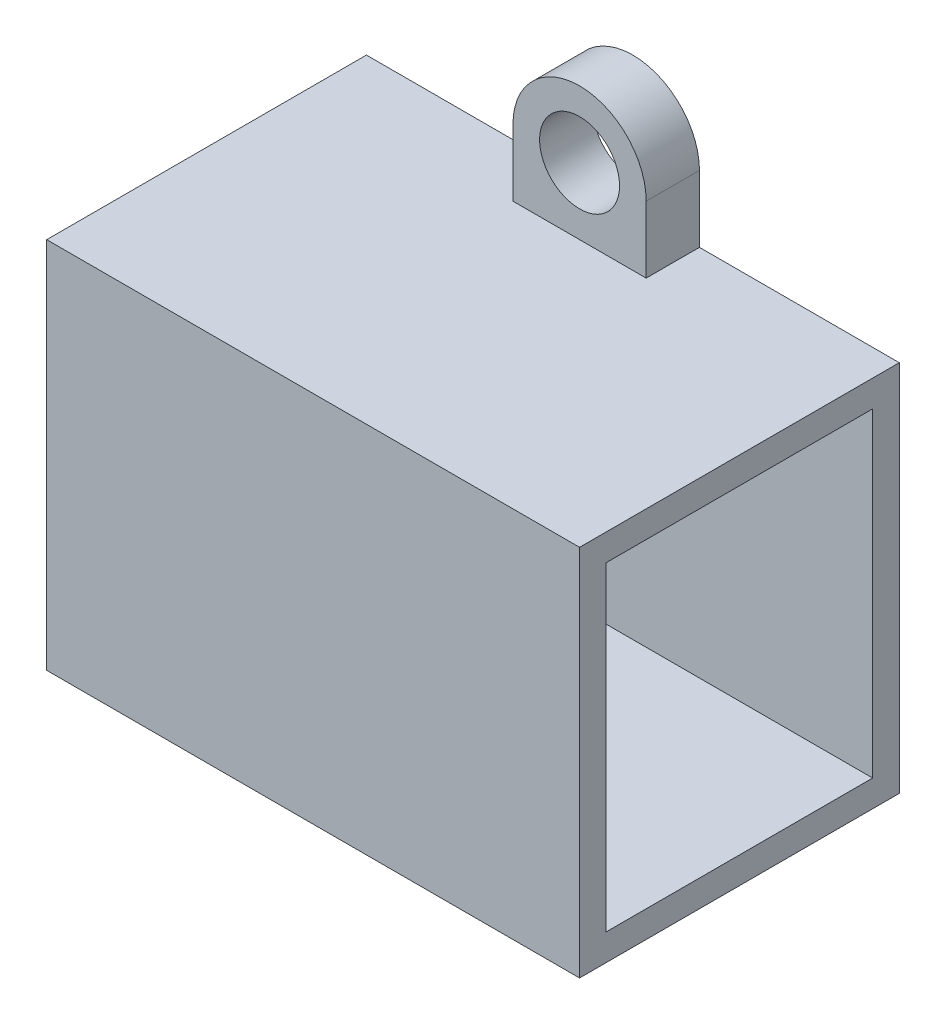
ISO-10303-21;
HEADER;
FILE_DESCRIPTION(('STEP AP214'),'2;1');
FILE_NAME('part.step','',(''),(''),'','','');
FILE_SCHEMA(('AUTOMOTIVE_DESIGN { 1 0 10303 214 1 1 1 1 }'));
ENDSEC;
DATA;
#1=APPLICATION_CONTEXT('core data for automotive mechanical design processes');
#2=APPLICATION_PROTOCOL_DEFINITION('international standard','automotive_design',2000,#1);
#3=PRODUCT_CONTEXT('',#1,'mechanical');
#4=PRODUCT('Part','Part','',(#3));
#5=PRODUCT_RELATED_PRODUCT_CATEGORY('part','',(#4));
#6=PRODUCT_DEFINITION_FORMATION('','',#4);
#7=PRODUCT_DEFINITION_CONTEXT('part definition',#1,'design');
#8=PRODUCT_DEFINITION('design','',#6,#7);
#9=PRODUCT_DEFINITION_SHAPE('','',#8);
#10=(LENGTH_UNIT() NAMED_UNIT(*) SI_UNIT(.MILLI.,.METRE.));
#11=(NAMED_UNIT(*) PLANE_ANGLE_UNIT() SI_UNIT($,.RADIAN.));
#12=(NAMED_UNIT(*) SI_UNIT($,.STERADIAN.) SOLID_ANGLE_UNIT());
#13=UNCERTAINTY_MEASURE_WITH_UNIT(LENGTH_MEASURE(1.E-05),#10,'distance_accuracy_value','');
#14=(GEOMETRIC_REPRESENTATION_CONTEXT(3) GLOBAL_UNCERTAINTY_ASSIGNED_CONTEXT((#13)) GLOBAL_UNIT_ASSIGNED_CONTEXT((#10,
#11,#12)) REPRESENTATION_CONTEXT('',''));
#15=CARTESIAN_POINT('',(0.,0.,0.));
#16=DIRECTION('',(0.,0.,1.));
#17=DIRECTION('',(1.,0.,0.));
#18=AXIS2_PLACEMENT_3D('',#15,#16,#17);
#19=CARTESIAN_POINT('',(10.,7.,12.));
#20=DIRECTION('',(-1.,0.,0.));
#21=DIRECTION('',(0.,-1.,0.));
#22=AXIS2_PLACEMENT_3D('',#19,#20,#21);
#23=PLANE('',#22);
#24=DIRECTION('',(0.,1.,0.));
#25=VECTOR('',#24,1.);
#26=CARTESIAN_POINT('',(10.,7.,0.));
#27=LINE('',#26,#25);
#28=CARTESIAN_POINT('',(10.,-7.,0.));
#29=VERTEX_POINT('',#28);
#30=CARTESIAN_POINT('',(10.,7.,0.));
#31=VERTEX_POINT('',#30);
#32=EDGE_CURVE('E291',#29,#31,#27,.T.);
#33=ORIENTED_EDGE('',*,*,#32,.T.);
#34=DIRECTION('',(0.,0.,-1.));
#35=VECTOR('',#34,1.);
#36=CARTESIAN_POINT('',(10.,7.,12.));
#37=LINE('',#36,#35);
#38=CARTESIAN_POINT('',(10.,7.,12.));
#39=VERTEX_POINT('',#38);
#40=EDGE_CURVE('E11',#39,#31,#37,.T.);
#41=ORIENTED_EDGE('',*,*,#40,.F.);
#42=DIRECTION('',(0.,1.,0.));
#43=VECTOR('',#42,1.);
#44=CARTESIAN_POINT('',(10.,7.,12.));
#45=LINE('',#44,#43);
#46=CARTESIAN_POINT('',(10.,-7.,12.));
#47=VERTEX_POINT('',#46);
#48=EDGE_CURVE('E292',#47,#39,#45,.T.);
#49=ORIENTED_EDGE('',*,*,#48,.F.);
#50=DIRECTION('',(0.,0.,-1.));
#51=VECTOR('',#50,1.);
#52=CARTESIAN_POINT('',(10.,-7.,12.));
#53=LINE('',#52,#51);
#54=EDGE_CURVE('E306',#47,#29,#53,.T.);
#55=ORIENTED_EDGE('',*,*,#54,.T.);
#56=EDGE_LOOP('',(#33,#41,#49,#55));
#57=FACE_BOUND('',#56,.T.);
#58=DIRECTION('',(0.,1.,0.));
#59=VECTOR('',#58,1.);
#60=CARTESIAN_POINT('',(10.,7.,1.));
#61=LINE('',#60,#59);
#62=CARTESIAN_POINT('',(10.,-6.,1.));
#63=VERTEX_POINT('',#62);
#64=CARTESIAN_POINT('',(10.,6.,1.));
#65=VERTEX_POINT('',#64);
#66=EDGE_CURVE('E159',#63,#65,#61,.T.);
#67=ORIENTED_EDGE('',*,*,#66,.F.);
#68=DIRECTION('',(0.,0.,-1.));
#69=VECTOR('',#68,1.);
#70=CARTESIAN_POINT('',(10.,-6.,12.));
#71=LINE('',#70,#69);
#72=CARTESIAN_POINT('',(10.,-6.,11.));
#73=VERTEX_POINT('',#72);
#74=EDGE_CURVE('E186',#73,#63,#71,.T.);
#75=ORIENTED_EDGE('',*,*,#74,.F.);
#76=DIRECTION('',(0.,1.,0.));
#77=VECTOR('',#76,1.);
#78=CARTESIAN_POINT('',(10.,7.,11.));
#79=LINE('',#78,#77);
#80=CARTESIAN_POINT('',(10.,6.,11.));
#81=VERTEX_POINT('',#80);
#82=EDGE_CURVE('E55',#73,#81,#79,.T.);
#83=ORIENTED_EDGE('',*,*,#82,.T.);
#84=DIRECTION('',(0.,0.,-1.));
#85=VECTOR('',#84,1.);
#86=CARTESIAN_POINT('',(10.,6.,12.));
#87=LINE('',#86,#85);
#88=EDGE_CURVE('E171',#81,#65,#87,.T.);
#89=ORIENTED_EDGE('',*,*,#88,.T.);
#90=EDGE_LOOP('',(#67,#75,#83,#89));
#91=FACE_BOUND('',#90,.T.);
#92=ADVANCED_FACE('F40',(#57,#91),#23,.F.);
#93=CARTESIAN_POINT('',(-10.,7.,12.));
#94=DIRECTION('',(1.,0.,0.));
#95=DIRECTION('',(0.,1.,0.));
#96=AXIS2_PLACEMENT_3D('',#93,#94,#95);
#97=PLANE('',#96);
#98=DIRECTION('',(0.,-1.,0.));
#99=VECTOR('',#98,1.);
#100=CARTESIAN_POINT('',(-10.,7.,0.));
#101=LINE('',#100,#99);
#102=CARTESIAN_POINT('',(-10.,7.,0.));
#103=VERTEX_POINT('',#102);
#104=CARTESIAN_POINT('',(-10.,-7.,0.));
#105=VERTEX_POINT('',#104);
#106=EDGE_CURVE('E314',#103,#105,#101,.T.);
#107=ORIENTED_EDGE('',*,*,#106,.T.);
#108=DIRECTION('',(0.,0.,-1.));
#109=VECTOR('',#108,1.);
#110=CARTESIAN_POINT('',(-10.,-7.,12.));
#111=LINE('',#110,#109);
#112=CARTESIAN_POINT('',(-10.,-7.,12.));
#113=VERTEX_POINT('',#112);
#114=EDGE_CURVE('E324',#113,#105,#111,.T.);
#115=ORIENTED_EDGE('',*,*,#114,.F.);
#116=DIRECTION('',(0.,-1.,0.));
#117=VECTOR('',#116,1.);
#118=CARTESIAN_POINT('',(-10.,7.,12.));
#119=LINE('',#118,#117);
#120=CARTESIAN_POINT('',(-10.,7.,12.));
#121=VERTEX_POINT('',#120);
#122=EDGE_CURVE('E300',#121,#113,#119,.T.);
#123=ORIENTED_EDGE('',*,*,#122,.F.);
#124=DIRECTION('',(0.,0.,-1.));
#125=VECTOR('',#124,1.);
#126=CARTESIAN_POINT('',(-10.,7.,12.));
#127=LINE('',#126,#125);
#128=EDGE_CURVE('E48',#121,#103,#127,.T.);
#129=ORIENTED_EDGE('',*,*,#128,.T.);
#130=EDGE_LOOP('',(#107,#115,#123,#129));
#131=FACE_BOUND('',#130,.T.);
#132=DIRECTION('',(0.,-1.,0.));
#133=VECTOR('',#132,1.);
#134=CARTESIAN_POINT('',(-10.,7.,1.));
#135=LINE('',#134,#133);
#136=CARTESIAN_POINT('',(-10.,6.,1.));
#137=VERTEX_POINT('',#136);
#138=CARTESIAN_POINT('',(-10.,-6.,1.));
#139=VERTEX_POINT('',#138);
#140=EDGE_CURVE('E156',#137,#139,#135,.T.);
#141=ORIENTED_EDGE('',*,*,#140,.F.);
#142=DIRECTION('',(0.,0.,-1.));
#143=VECTOR('',#142,1.);
#144=CARTESIAN_POINT('',(-10.,6.,12.));
#145=LINE('',#144,#143);
#146=CARTESIAN_POINT('',(-10.,6.,11.));
#147=VERTEX_POINT('',#146);
#148=EDGE_CURVE('E166',#147,#137,#145,.T.);
#149=ORIENTED_EDGE('',*,*,#148,.F.);
#150=DIRECTION('',(0.,-1.,0.));
#151=VECTOR('',#150,1.);
#152=CARTESIAN_POINT('',(-10.,7.,11.));
#153=LINE('',#152,#151);
#154=CARTESIAN_POINT('',(-10.,-6.,11.));
#155=VERTEX_POINT('',#154);
#156=EDGE_CURVE('E60',#147,#155,#153,.T.);
#157=ORIENTED_EDGE('',*,*,#156,.T.);
#158=DIRECTION('',(0.,0.,-1.));
#159=VECTOR('',#158,1.);
#160=CARTESIAN_POINT('',(-10.,-6.,12.));
#161=LINE('',#160,#159);
#162=EDGE_CURVE('E172',#155,#139,#161,.T.);
#163=ORIENTED_EDGE('',*,*,#162,.T.);
#164=EDGE_LOOP('',(#141,#149,#157,#163));
#165=FACE_BOUND('',#164,.T.);
#166=ADVANCED_FACE('F175',(#131,#165),#97,.F.);
#167=CARTESIAN_POINT('',(-10.,7.,12.));
#168=DIRECTION('',(0.,-1.,0.));
#169=DIRECTION('',(0.,0.,-1.));
#170=AXIS2_PLACEMENT_3D('',#167,#168,#169);
#171=PLANE('',#170);
#172=DIRECTION('',(0.,0.,-1.));
#173=VECTOR('',#172,1.);
#174=CARTESIAN_POINT('',(2.5,7.,2.));
#175=LINE('',#174,#173);
#176=CARTESIAN_POINT('',(2.5,7.,2.));
#177=VERTEX_POINT('',#176);
#178=CARTESIAN_POINT('',(2.5,7.,0.));
#179=VERTEX_POINT('',#178);
#180=EDGE_CURVE('E234',#177,#179,#175,.T.);
#181=ORIENTED_EDGE('',*,*,#180,.F.);
#182=DIRECTION('',(1.,0.,0.));
#183=VECTOR('',#182,1.);
#184=CARTESIAN_POINT('',(-2.5,7.,2.));
#185=LINE('',#184,#183);
#186=CARTESIAN_POINT('',(-2.5,7.,2.));
#187=VERTEX_POINT('',#186);
#188=EDGE_CURVE('E216',#187,#177,#185,.T.);
#189=ORIENTED_EDGE('',*,*,#188,.F.);
#190=DIRECTION('',(0.,0.,-1.));
#191=VECTOR('',#190,1.);
#192=CARTESIAN_POINT('',(-2.5,7.,2.));
#193=LINE('',#192,#191);
#194=CARTESIAN_POINT('',(-2.5,7.,0.));
#195=VERTEX_POINT('',#194);
#196=EDGE_CURVE('E237',#187,#195,#193,.T.);
#197=ORIENTED_EDGE('',*,*,#196,.T.);
#198=DIRECTION('',(-1.,0.,0.));
#199=VECTOR('',#198,1.);
#200=CARTESIAN_POINT('',(-10.,7.,0.));
#201=LINE('',#200,#199);
#202=EDGE_CURVE('E309',#195,#103,#201,.T.);
#203=ORIENTED_EDGE('',*,*,#202,.T.);
#204=ORIENTED_EDGE('',*,*,#128,.F.);
#205=DIRECTION('',(-1.,0.,0.));
#206=VECTOR('',#205,1.);
#207=CARTESIAN_POINT('',(-10.,7.,12.));
#208=LINE('',#207,#206);
#209=EDGE_CURVE('E296',#39,#121,#208,.T.);
#210=ORIENTED_EDGE('',*,*,#209,.F.);
#211=ORIENTED_EDGE('',*,*,#40,.T.);
#212=EDGE_CURVE('E310',#31,#179,#201,.T.);
#213=ORIENTED_EDGE('',*,*,#212,.T.);
#214=EDGE_LOOP('',(#181,#189,#197,#203,#204,#210,#211,#213));
#215=FACE_BOUND('',#214,.T.);
#216=ADVANCED_FACE('F354',(#215),#171,.F.);
#217=CARTESIAN_POINT('',(-10.,-7.,12.));
#218=DIRECTION('',(0.,1.,0.));
#219=DIRECTION('',(0.,0.,1.));
#220=AXIS2_PLACEMENT_3D('',#217,#218,#219);
#221=PLANE('',#220);
#222=DIRECTION('',(0.,0.,-1.));
#223=VECTOR('',#222,1.);
#224=CARTESIAN_POINT('',(-2.5,-7.,2.));
#225=LINE('',#224,#223);
#226=CARTESIAN_POINT('',(-2.5,-7.,2.));
#227=VERTEX_POINT('',#226);
#228=CARTESIAN_POINT('',(-2.5,-7.,0.));
#229=VERTEX_POINT('',#228);
#230=EDGE_CURVE('E280',#227,#229,#225,.T.);
#231=ORIENTED_EDGE('',*,*,#230,.F.);
#232=DIRECTION('',(-1.,0.,0.));
#233=VECTOR('',#232,1.);
#234=CARTESIAN_POINT('',(-2.5,-7.,2.));
#235=LINE('',#234,#233);
#236=CARTESIAN_POINT('',(2.5,-7.,2.));
#237=VERTEX_POINT('',#236);
#238=EDGE_CURVE('E262',#237,#227,#235,.T.);
#239=ORIENTED_EDGE('',*,*,#238,.F.);
#240=DIRECTION('',(0.,0.,-1.));
#241=VECTOR('',#240,1.);
#242=CARTESIAN_POINT('',(2.5,-7.,2.));
#243=LINE('',#242,#241);
#244=CARTESIAN_POINT('',(2.5,-7.,0.));
#245=VERTEX_POINT('',#244);
#246=EDGE_CURVE('E283',#237,#245,#243,.T.);
#247=ORIENTED_EDGE('',*,*,#246,.T.);
#248=DIRECTION('',(1.,0.,0.));
#249=VECTOR('',#248,1.);
#250=CARTESIAN_POINT('',(-10.,-7.,0.));
#251=LINE('',#250,#249);
#252=EDGE_CURVE('E317',#245,#29,#251,.T.);
#253=ORIENTED_EDGE('',*,*,#252,.T.);
#254=ORIENTED_EDGE('',*,*,#54,.F.);
#255=DIRECTION('',(1.,0.,0.));
#256=VECTOR('',#255,1.);
#257=CARTESIAN_POINT('',(-10.,-7.,12.));
#258=LINE('',#257,#256);
#259=EDGE_CURVE('E303',#113,#47,#258,.T.);
#260=ORIENTED_EDGE('',*,*,#259,.F.);
#261=ORIENTED_EDGE('',*,*,#114,.T.);
#262=EDGE_CURVE('E297',#105,#229,#251,.T.);
#263=ORIENTED_EDGE('',*,*,#262,.T.);
#264=EDGE_LOOP('',(#231,#239,#247,#253,#254,#260,#261,#263));
#265=FACE_BOUND('',#264,.T.);
#266=ADVANCED_FACE('F345',(#265),#221,.F.);
#267=CARTESIAN_POINT('',(0.,0.,12.));
#268=DIRECTION('',(0.,0.,1.));
#269=DIRECTION('',(1.,0.,0.));
#270=AXIS2_PLACEMENT_3D('',#267,#268,#269);
#271=PLANE('',#270);
#272=ORIENTED_EDGE('',*,*,#48,.T.);
#273=ORIENTED_EDGE('',*,*,#209,.T.);
#274=ORIENTED_EDGE('',*,*,#122,.T.);
#275=ORIENTED_EDGE('',*,*,#259,.T.);
#276=EDGE_LOOP('',(#272,#273,#274,#275));
#277=FACE_BOUND('',#276,.T.);
#278=ADVANCED_FACE('F351',(#277),#271,.T.);
#279=CARTESIAN_POINT('',(0.,0.,0.));
#280=DIRECTION('',(0.,0.,1.));
#281=DIRECTION('',(1.,0.,0.));
#282=AXIS2_PLACEMENT_3D('',#279,#280,#281);
#283=PLANE('',#282);
#284=ORIENTED_EDGE('',*,*,#32,.F.);
#285=ORIENTED_EDGE('',*,*,#252,.F.);
#286=DIRECTION('',(0.,1.,0.));
#287=VECTOR('',#286,1.);
#288=CARTESIAN_POINT('',(2.5,-9.5,0.));
#289=LINE('',#288,#287);
#290=CARTESIAN_POINT('',(2.5,-9.5,0.));
#291=VERTEX_POINT('',#290);
#292=EDGE_CURVE('E272',#291,#245,#289,.T.);
#293=ORIENTED_EDGE('',*,*,#292,.F.);
#294=CARTESIAN_POINT('',(0.,-9.5,0.));
#295=DIRECTION('',(0.,0.,1.));
#296=DIRECTION('',(1.,0.,0.));
#297=AXIS2_PLACEMENT_3D('',#294,#295,#296);
#298=CIRCLE('',#297,2.5);
#299=CARTESIAN_POINT('',(-2.5,-9.5,0.));
#300=VERTEX_POINT('',#299);
#301=EDGE_CURVE('E250',#300,#291,#298,.T.);
#302=ORIENTED_EDGE('',*,*,#301,.F.);
#303=DIRECTION('',(0.,-1.,0.));
#304=VECTOR('',#303,1.);
#305=CARTESIAN_POINT('',(-2.5,-9.5,0.));
#306=LINE('',#305,#304);
#307=EDGE_CURVE('E259',#229,#300,#306,.T.);
#308=ORIENTED_EDGE('',*,*,#307,.F.);
#309=ORIENTED_EDGE('',*,*,#262,.F.);
#310=ORIENTED_EDGE('',*,*,#106,.F.);
#311=ORIENTED_EDGE('',*,*,#202,.F.);
#312=DIRECTION('',(0.,-1.,0.));
#313=VECTOR('',#312,1.);
#314=CARTESIAN_POINT('',(-2.5,9.5,0.));
#315=LINE('',#314,#313);
#316=CARTESIAN_POINT('',(-2.5,9.5,0.));
#317=VERTEX_POINT('',#316);
#318=EDGE_CURVE('E226',#317,#195,#315,.T.);
#319=ORIENTED_EDGE('',*,*,#318,.F.);
#320=CARTESIAN_POINT('',(0.,9.5,0.));
#321=DIRECTION('',(0.,0.,1.));
#322=DIRECTION('',(1.,0.,0.));
#323=AXIS2_PLACEMENT_3D('',#320,#321,#322);
#324=CIRCLE('',#323,2.5);
#325=CARTESIAN_POINT('',(2.5,9.5,0.));
#326=VERTEX_POINT('',#325);
#327=EDGE_CURVE('E204',#326,#317,#324,.T.);
#328=ORIENTED_EDGE('',*,*,#327,.F.);
#329=DIRECTION('',(0.,1.,0.));
#330=VECTOR('',#329,1.);
#331=CARTESIAN_POINT('',(2.5,9.5,0.));
#332=LINE('',#331,#330);
#333=EDGE_CURVE('E213',#179,#326,#332,.T.);
#334=ORIENTED_EDGE('',*,*,#333,.F.);
#335=ORIENTED_EDGE('',*,*,#212,.F.);
#336=EDGE_LOOP('',(#284,#285,#293,#302,#308,#309,#310,#311,#319,#328,#334,#335));
#337=FACE_BOUND('',#336,.T.);
#338=CARTESIAN_POINT('',(0.,-9.5,0.));
#339=DIRECTION('',(0.,0.,1.));
#340=DIRECTION('',(1.,0.,0.));
#341=AXIS2_PLACEMENT_3D('',#338,#339,#340);
#342=CIRCLE('',#341,1.5);
#343=CARTESIAN_POINT('',(1.5,-9.5,0.));
#344=VERTEX_POINT('',#343);
#345=EDGE_CURVE('E245',#344,#344,#342,.T.);
#346=ORIENTED_EDGE('',*,*,#345,.T.);
#347=EDGE_LOOP('',(#346));
#348=FACE_BOUND('',#347,.T.);
#349=CARTESIAN_POINT('',(0.,9.5,0.));
#350=DIRECTION('',(0.,0.,1.));
#351=DIRECTION('',(1.,0.,0.));
#352=AXIS2_PLACEMENT_3D('',#349,#350,#351);
#353=CIRCLE('',#352,1.5);
#354=CARTESIAN_POINT('',(1.5,9.5,0.));
#355=VERTEX_POINT('',#354);
#356=EDGE_CURVE('E192',#355,#355,#353,.T.);
#357=ORIENTED_EDGE('',*,*,#356,.T.);
#358=EDGE_LOOP('',(#357));
#359=FACE_BOUND('',#358,.T.);
#360=ADVANCED_FACE('F339',(#337,#348,#359),#283,.F.);
#361=CARTESIAN_POINT('',(0.,-9.5,2.));
#362=DIRECTION('',(0.,0.,1.));
#363=DIRECTION('',(1.,0.,0.));
#364=AXIS2_PLACEMENT_3D('',#361,#362,#363);
#365=PLANE('',#364);
#366=CARTESIAN_POINT('',(0.,-9.5,2.));
#367=DIRECTION('',(0.,0.,1.));
#368=DIRECTION('',(1.,0.,0.));
#369=AXIS2_PLACEMENT_3D('',#366,#367,#368);
#370=CIRCLE('',#369,2.5);
#371=CARTESIAN_POINT('',(-2.5,-9.5,2.));
#372=VERTEX_POINT('',#371);
#373=CARTESIAN_POINT('',(2.5,-9.5,2.));
#374=VERTEX_POINT('',#373);
#375=EDGE_CURVE('E254',#372,#374,#370,.T.);
#376=ORIENTED_EDGE('',*,*,#375,.T.);
#377=DIRECTION('',(0.,1.,0.));
#378=VECTOR('',#377,1.);
#379=CARTESIAN_POINT('',(2.5,-9.5,2.));
#380=LINE('',#379,#378);
#381=EDGE_CURVE('E258',#374,#237,#380,.T.);
#382=ORIENTED_EDGE('',*,*,#381,.T.);
#383=ORIENTED_EDGE('',*,*,#238,.T.);
#384=DIRECTION('',(0.,-1.,0.));
#385=VECTOR('',#384,1.);
#386=CARTESIAN_POINT('',(-2.5,-9.5,2.));
#387=LINE('',#386,#385);
#388=EDGE_CURVE('E265',#227,#372,#387,.T.);
#389=ORIENTED_EDGE('',*,*,#388,.T.);
#390=EDGE_LOOP('',(#376,#382,#383,#389));
#391=FACE_BOUND('',#390,.T.);
#392=CARTESIAN_POINT('',(0.,-9.5,2.));
#393=DIRECTION('',(0.,0.,1.));
#394=DIRECTION('',(1.,0.,0.));
#395=AXIS2_PLACEMENT_3D('',#392,#393,#394);
#396=CIRCLE('',#395,1.5);
#397=CARTESIAN_POINT('',(1.5,-9.5,2.));
#398=VERTEX_POINT('',#397);
#399=EDGE_CURVE('E246',#398,#398,#396,.T.);
#400=ORIENTED_EDGE('',*,*,#399,.F.);
#401=EDGE_LOOP('',(#400));
#402=FACE_BOUND('',#401,.T.);
#403=ADVANCED_FACE('F397',(#391,#402),#365,.T.);
#404=CARTESIAN_POINT('',(0.,-9.5,2.));
#405=DIRECTION('',(0.,0.,-1.));
#406=DIRECTION('',(-1.,0.,0.));
#407=AXIS2_PLACEMENT_3D('',#404,#405,#406);
#408=CYLINDRICAL_SURFACE('',#407,2.5);
#409=ORIENTED_EDGE('',*,*,#301,.T.);
#410=DIRECTION('',(0.,0.,-1.));
#411=VECTOR('',#410,1.);
#412=CARTESIAN_POINT('',(2.5,-9.5,2.));
#413=LINE('',#412,#411);
#414=EDGE_CURVE('E287',#374,#291,#413,.T.);
#415=ORIENTED_EDGE('',*,*,#414,.F.);
#416=ORIENTED_EDGE('',*,*,#375,.F.);
#417=DIRECTION('',(0.,0.,-1.));
#418=VECTOR('',#417,1.);
#419=CARTESIAN_POINT('',(-2.5,-9.5,2.));
#420=LINE('',#419,#418);
#421=EDGE_CURVE('E268',#372,#300,#420,.T.);
#422=ORIENTED_EDGE('',*,*,#421,.T.);
#423=EDGE_LOOP('',(#409,#415,#416,#422));
#424=FACE_BOUND('',#423,.T.);
#425=ADVANCED_FACE('F400',(#424),#408,.T.);
#426=CARTESIAN_POINT('',(2.5,-9.5,2.));
#427=DIRECTION('',(-1.,0.,0.));
#428=DIRECTION('',(0.,0.,1.));
#429=AXIS2_PLACEMENT_3D('',#426,#427,#428);
#430=PLANE('',#429);
#431=ORIENTED_EDGE('',*,*,#292,.T.);
#432=ORIENTED_EDGE('',*,*,#246,.F.);
#433=ORIENTED_EDGE('',*,*,#381,.F.);
#434=ORIENTED_EDGE('',*,*,#414,.T.);
#435=EDGE_LOOP('',(#431,#432,#433,#434));
#436=FACE_BOUND('',#435,.T.);
#437=ADVANCED_FACE('F403',(#436),#430,.F.);
#438=CARTESIAN_POINT('',(-2.5,-9.5,2.));
#439=DIRECTION('',(1.,0.,0.));
#440=DIRECTION('',(0.,0.,-1.));
#441=AXIS2_PLACEMENT_3D('',#438,#439,#440);
#442=PLANE('',#441);
#443=ORIENTED_EDGE('',*,*,#307,.T.);
#444=ORIENTED_EDGE('',*,*,#421,.F.);
#445=ORIENTED_EDGE('',*,*,#388,.F.);
#446=ORIENTED_EDGE('',*,*,#230,.T.);
#447=EDGE_LOOP('',(#443,#444,#445,#446));
#448=FACE_BOUND('',#447,.T.);
#449=ADVANCED_FACE('F407',(#448),#442,.F.);
#450=CARTESIAN_POINT('',(0.,-9.5,2.));
#451=DIRECTION('',(0.,0.,-1.));
#452=DIRECTION('',(-1.,0.,0.));
#453=AXIS2_PLACEMENT_3D('',#450,#451,#452);
#454=CYLINDRICAL_SURFACE('',#453,1.5);
#455=ORIENTED_EDGE('',*,*,#399,.T.);
#456=EDGE_LOOP('',(#455));
#457=FACE_BOUND('',#456,.T.);
#458=ORIENTED_EDGE('',*,*,#345,.F.);
#459=EDGE_LOOP('',(#458));
#460=FACE_BOUND('',#459,.T.);
#461=ADVANCED_FACE('F411',(#457,#460),#454,.F.);
#462=CARTESIAN_POINT('',(0.,9.5,2.));
#463=DIRECTION('',(0.,0.,1.));
#464=DIRECTION('',(1.,0.,0.));
#465=AXIS2_PLACEMENT_3D('',#462,#463,#464);
#466=PLANE('',#465);
#467=CARTESIAN_POINT('',(0.,9.5,2.));
#468=DIRECTION('',(0.,0.,1.));
#469=DIRECTION('',(1.,0.,0.));
#470=AXIS2_PLACEMENT_3D('',#467,#468,#469);
#471=CIRCLE('',#470,2.5);
#472=CARTESIAN_POINT('',(2.5,9.5,2.));
#473=VERTEX_POINT('',#472);
#474=CARTESIAN_POINT('',(-2.5,9.5,2.));
#475=VERTEX_POINT('',#474);
#476=EDGE_CURVE('E208',#473,#475,#471,.T.);
#477=ORIENTED_EDGE('',*,*,#476,.T.);
#478=DIRECTION('',(0.,-1.,0.));
#479=VECTOR('',#478,1.);
#480=CARTESIAN_POINT('',(-2.5,9.5,2.));
#481=LINE('',#480,#479);
#482=EDGE_CURVE('E212',#475,#187,#481,.T.);
#483=ORIENTED_EDGE('',*,*,#482,.T.);
#484=ORIENTED_EDGE('',*,*,#188,.T.);
#485=DIRECTION('',(0.,1.,0.));
#486=VECTOR('',#485,1.);
#487=CARTESIAN_POINT('',(2.5,9.5,2.));
#488=LINE('',#487,#486);
#489=EDGE_CURVE('E219',#177,#473,#488,.T.);
#490=ORIENTED_EDGE('',*,*,#489,.T.);
#491=EDGE_LOOP('',(#477,#483,#484,#490));
#492=FACE_BOUND('',#491,.T.);
#493=CARTESIAN_POINT('',(0.,9.5,2.));
#494=DIRECTION('',(0.,0.,1.));
#495=DIRECTION('',(1.,0.,0.));
#496=AXIS2_PLACEMENT_3D('',#493,#494,#495);
#497=CIRCLE('',#496,1.5);
#498=CARTESIAN_POINT('',(1.5,9.5,2.));
#499=VERTEX_POINT('',#498);
#500=EDGE_CURVE('E200',#499,#499,#497,.T.);
#501=ORIENTED_EDGE('',*,*,#500,.F.);
#502=EDGE_LOOP('',(#501));
#503=FACE_BOUND('',#502,.T.);
#504=ADVANCED_FACE('F369',(#492,#503),#466,.T.);
#505=CARTESIAN_POINT('',(0.,9.5,2.));
#506=DIRECTION('',(0.,0.,-1.));
#507=DIRECTION('',(-1.,0.,0.));
#508=AXIS2_PLACEMENT_3D('',#505,#506,#507);
#509=CYLINDRICAL_SURFACE('',#508,2.5);
#510=ORIENTED_EDGE('',*,*,#327,.T.);
#511=DIRECTION('',(0.,0.,-1.));
#512=VECTOR('',#511,1.);
#513=CARTESIAN_POINT('',(-2.5,9.5,2.));
#514=LINE('',#513,#512);
#515=EDGE_CURVE('E241',#475,#317,#514,.T.);
#516=ORIENTED_EDGE('',*,*,#515,.F.);
#517=ORIENTED_EDGE('',*,*,#476,.F.);
#518=DIRECTION('',(0.,0.,-1.));
#519=VECTOR('',#518,1.);
#520=CARTESIAN_POINT('',(2.5,9.5,2.));
#521=LINE('',#520,#519);
#522=EDGE_CURVE('E222',#473,#326,#521,.T.);
#523=ORIENTED_EDGE('',*,*,#522,.T.);
#524=EDGE_LOOP('',(#510,#516,#517,#523));
#525=FACE_BOUND('',#524,.T.);
#526=ADVANCED_FACE('F366',(#525),#509,.T.);
#527=CARTESIAN_POINT('',(-2.5,9.5,2.));
#528=DIRECTION('',(1.,0.,0.));
#529=DIRECTION('',(0.,1.,0.));
#530=AXIS2_PLACEMENT_3D('',#527,#528,#529);
#531=PLANE('',#530);
#532=ORIENTED_EDGE('',*,*,#318,.T.);
#533=ORIENTED_EDGE('',*,*,#196,.F.);
#534=ORIENTED_EDGE('',*,*,#482,.F.);
#535=ORIENTED_EDGE('',*,*,#515,.T.);
#536=EDGE_LOOP('',(#532,#533,#534,#535));
#537=FACE_BOUND('',#536,.T.);
#538=ADVANCED_FACE('F374',(#537),#531,.F.);
#539=CARTESIAN_POINT('',(2.5,9.5,2.));
#540=DIRECTION('',(-1.,0.,0.));
#541=DIRECTION('',(0.,-1.,0.));
#542=AXIS2_PLACEMENT_3D('',#539,#540,#541);
#543=PLANE('',#542);
#544=ORIENTED_EDGE('',*,*,#333,.T.);
#545=ORIENTED_EDGE('',*,*,#522,.F.);
#546=ORIENTED_EDGE('',*,*,#489,.F.);
#547=ORIENTED_EDGE('',*,*,#180,.T.);
#548=EDGE_LOOP('',(#544,#545,#546,#547));
#549=FACE_BOUND('',#548,.T.);
#550=ADVANCED_FACE('F362',(#549),#543,.F.);
#551=CARTESIAN_POINT('',(0.,9.5,2.));
#552=DIRECTION('',(0.,0.,-1.));
#553=DIRECTION('',(-1.,0.,0.));
#554=AXIS2_PLACEMENT_3D('',#551,#552,#553);
#555=CYLINDRICAL_SURFACE('',#554,1.5);
#556=ORIENTED_EDGE('',*,*,#500,.T.);
#557=EDGE_LOOP('',(#556));
#558=FACE_BOUND('',#557,.T.);
#559=ORIENTED_EDGE('',*,*,#356,.F.);
#560=EDGE_LOOP('',(#559));
#561=FACE_BOUND('',#560,.T.);
#562=ADVANCED_FACE('F381',(#558,#561),#555,.F.);
#563=CARTESIAN_POINT('',(-10.,6.,12.));
#564=DIRECTION('',(0.,-1.,0.));
#565=DIRECTION('',(0.,0.,-1.));
#566=AXIS2_PLACEMENT_3D('',#563,#564,#565);
#567=PLANE('',#566);
#568=DIRECTION('',(-1.,0.,0.));
#569=VECTOR('',#568,1.);
#570=CARTESIAN_POINT('',(-10.,6.,1.));
#571=LINE('',#570,#569);
#572=EDGE_CURVE('E152',#65,#137,#571,.T.);
#573=ORIENTED_EDGE('',*,*,#572,.F.);
#574=ORIENTED_EDGE('',*,*,#88,.F.);
#575=DIRECTION('',(-1.,0.,0.));
#576=VECTOR('',#575,1.);
#577=CARTESIAN_POINT('',(-10.,6.,11.));
#578=LINE('',#577,#576);
#579=EDGE_CURVE('E168',#81,#147,#578,.T.);
#580=ORIENTED_EDGE('',*,*,#579,.T.);
#581=ORIENTED_EDGE('',*,*,#148,.T.);
#582=EDGE_LOOP('',(#573,#574,#580,#581));
#583=FACE_BOUND('',#582,.T.);
#584=ADVANCED_FACE('F167',(#583),#567,.T.);
#585=CARTESIAN_POINT('',(-10.,-6.,12.));
#586=DIRECTION('',(0.,1.,0.));
#587=DIRECTION('',(0.,0.,1.));
#588=AXIS2_PLACEMENT_3D('',#585,#586,#587);
#589=PLANE('',#588);
#590=DIRECTION('',(1.,0.,0.));
#591=VECTOR('',#590,1.);
#592=CARTESIAN_POINT('',(-10.,-6.,1.));
#593=LINE('',#592,#591);
#594=EDGE_CURVE('E177',#139,#63,#593,.T.);
#595=ORIENTED_EDGE('',*,*,#594,.F.);
#596=ORIENTED_EDGE('',*,*,#162,.F.);
#597=DIRECTION('',(1.,0.,0.));
#598=VECTOR('',#597,1.);
#599=CARTESIAN_POINT('',(-10.,-6.,11.));
#600=LINE('',#599,#598);
#601=EDGE_CURVE('E189',#155,#73,#600,.T.);
#602=ORIENTED_EDGE('',*,*,#601,.T.);
#603=ORIENTED_EDGE('',*,*,#74,.T.);
#604=EDGE_LOOP('',(#595,#596,#602,#603));
#605=FACE_BOUND('',#604,.T.);
#606=ADVANCED_FACE('F434',(#605),#589,.T.);
#607=CARTESIAN_POINT('',(0.,0.,11.));
#608=DIRECTION('',(0.,0.,1.));
#609=DIRECTION('',(1.,0.,0.));
#610=AXIS2_PLACEMENT_3D('',#607,#608,#609);
#611=PLANE('',#610);
#612=ORIENTED_EDGE('',*,*,#82,.F.);
#613=ORIENTED_EDGE('',*,*,#601,.F.);
#614=ORIENTED_EDGE('',*,*,#156,.F.);
#615=ORIENTED_EDGE('',*,*,#579,.F.);
#616=EDGE_LOOP('',(#612,#613,#614,#615));
#617=FACE_BOUND('',#616,.T.);
#618=ADVANCED_FACE('F439',(#617),#611,.F.);
#619=CARTESIAN_POINT('',(0.,0.,1.));
#620=DIRECTION('',(0.,0.,1.));
#621=DIRECTION('',(1.,0.,0.));
#622=AXIS2_PLACEMENT_3D('',#619,#620,#621);
#623=PLANE('',#622);
#624=ORIENTED_EDGE('',*,*,#140,.T.);
#625=ORIENTED_EDGE('',*,*,#594,.T.);
#626=ORIENTED_EDGE('',*,*,#66,.T.);
#627=ORIENTED_EDGE('',*,*,#572,.T.);
#628=EDGE_LOOP('',(#624,#625,#626,#627));
#629=FACE_BOUND('',#628,.T.);
#630=ADVANCED_FACE('F154',(#629),#623,.T.);
#631=CLOSED_SHELL('',(#92,#166,#216,#266,#278,#360,#403,#425,#437,#449,#461,#504,#526,#538,#550,
#562,#584,#606,#618,#630));
#632=MANIFOLD_SOLID_BREP('B2',#631);
#633=ADVANCED_BREP_SHAPE_REPRESENTATION('',(#18,#632),#14);
#634=SHAPE_DEFINITION_REPRESENTATION(#9,#633);
ENDSEC;
END-ISO-10303-21;
